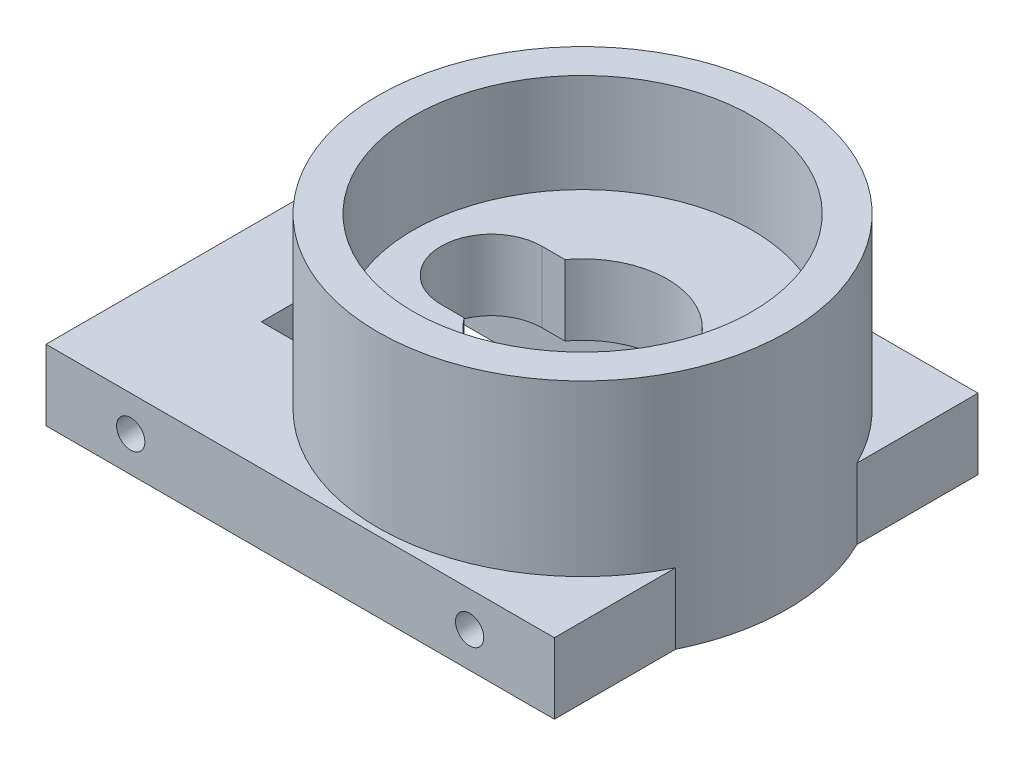
ISO-10303-21;
HEADER;
FILE_DESCRIPTION(('STEP AP214'),'2;1');
FILE_NAME('part.step','',(''),(''),'','','');
FILE_SCHEMA(('AUTOMOTIVE_DESIGN { 1 0 10303 214 1 1 1 1 }'));
ENDSEC;
DATA;
#1=APPLICATION_CONTEXT('core data for automotive mechanical design processes');
#2=APPLICATION_PROTOCOL_DEFINITION('international standard','automotive_design',2000,#1);
#3=PRODUCT_CONTEXT('',#1,'mechanical');
#4=PRODUCT('Part','Part','',(#3));
#5=PRODUCT_RELATED_PRODUCT_CATEGORY('part','',(#4));
#6=PRODUCT_DEFINITION_FORMATION('','',#4);
#7=PRODUCT_DEFINITION_CONTEXT('part definition',#1,'design');
#8=PRODUCT_DEFINITION('design','',#6,#7);
#9=PRODUCT_DEFINITION_SHAPE('','',#8);
#10=(LENGTH_UNIT() NAMED_UNIT(*) SI_UNIT(.MILLI.,.METRE.));
#11=(NAMED_UNIT(*) PLANE_ANGLE_UNIT() SI_UNIT($,.RADIAN.));
#12=(NAMED_UNIT(*) SI_UNIT($,.STERADIAN.) SOLID_ANGLE_UNIT());
#13=UNCERTAINTY_MEASURE_WITH_UNIT(LENGTH_MEASURE(1.E-05),#10,'distance_accuracy_value','');
#14=(GEOMETRIC_REPRESENTATION_CONTEXT(3) GLOBAL_UNCERTAINTY_ASSIGNED_CONTEXT((#13)) GLOBAL_UNIT_ASSIGNED_CONTEXT((#10,
#11,#12)) REPRESENTATION_CONTEXT('',''));
#15=CARTESIAN_POINT('',(0.,0.,0.));
#16=DIRECTION('',(0.,0.,1.));
#17=DIRECTION('',(1.,0.,0.));
#18=AXIS2_PLACEMENT_3D('',#15,#16,#17);
#19=CARTESIAN_POINT('',(0.,5.,0.));
#20=DIRECTION('',(0.,1.,0.));
#21=DIRECTION('',(0.,0.,1.));
#22=AXIS2_PLACEMENT_3D('',#19,#20,#21);
#23=PLANE('',#22);
#24=DIRECTION('',(-1.,0.,0.));
#25=VECTOR('',#24,1.);
#26=CARTESIAN_POINT('',(-11.75,5.,6.));
#27=LINE('',#26,#25);
#28=CARTESIAN_POINT('',(11.75,5.,6.));
#29=VERTEX_POINT('',#28);
#30=CARTESIAN_POINT('',(5.,5.,6.));
#31=VERTEX_POINT('',#30);
#32=EDGE_CURVE('E214',#29,#31,#27,.T.);
#33=ORIENTED_EDGE('',*,*,#32,.T.);
#34=CARTESIAN_POINT('',(5.,5.,0.));
#35=DIRECTION('',(0.,1.,0.));
#36=DIRECTION('',(0.,0.,1.));
#37=AXIS2_PLACEMENT_3D('',#34,#35,#36);
#38=CIRCLE('',#37,6.);
#39=CARTESIAN_POINT('',(5.,5.,-6.));
#40=VERTEX_POINT('',#39);
#41=EDGE_CURVE('E58',#40,#31,#38,.F.);
#42=ORIENTED_EDGE('',*,*,#41,.F.);
#43=DIRECTION('',(1.,0.,0.));
#44=VECTOR('',#43,1.);
#45=CARTESIAN_POINT('',(-11.75,5.,-6.));
#46=LINE('',#45,#44);
#47=CARTESIAN_POINT('',(11.75,5.,-6.));
#48=VERTEX_POINT('',#47);
#49=EDGE_CURVE('E228',#40,#48,#46,.T.);
#50=ORIENTED_EDGE('',*,*,#49,.T.);
#51=DIRECTION('',(0.,0.,1.));
#52=VECTOR('',#51,1.);
#53=CARTESIAN_POINT('',(11.75,5.,-6.));
#54=LINE('',#53,#52);
#55=EDGE_CURVE('E219',#48,#29,#54,.T.);
#56=ORIENTED_EDGE('',*,*,#55,.T.);
#57=EDGE_LOOP('',(#33,#42,#50,#56));
#58=FACE_BOUND('',#57,.T.);
#59=ADVANCED_FACE('F35',(#58),#23,.F.);
#60=CARTESIAN_POINT('',(0.,2.,0.));
#61=DIRECTION('',(0.,-1.,0.));
#62=DIRECTION('',(0.,0.,-1.));
#63=AXIS2_PLACEMENT_3D('',#60,#61,#62);
#64=PLANE('',#63);
#65=DIRECTION('',(0.,0.,-1.));
#66=VECTOR('',#65,1.);
#67=CARTESIAN_POINT('',(-11.75,2.,0.));
#68=LINE('',#67,#66);
#69=CARTESIAN_POINT('',(-11.75,2.,6.));
#70=VERTEX_POINT('',#69);
#71=CARTESIAN_POINT('',(-11.75,2.,-6.));
#72=VERTEX_POINT('',#71);
#73=EDGE_CURVE('E334',#70,#72,#68,.T.);
#74=ORIENTED_EDGE('',*,*,#73,.F.);
#75=DIRECTION('',(-1.,0.,0.));
#76=VECTOR('',#75,1.);
#77=CARTESIAN_POINT('',(-16.5,2.,6.));
#78=LINE('',#77,#76);
#79=CARTESIAN_POINT('',(-16.5,2.,6.));
#80=VERTEX_POINT('',#79);
#81=EDGE_CURVE('E255',#70,#80,#78,.T.);
#82=ORIENTED_EDGE('',*,*,#81,.T.);
#83=DIRECTION('',(0.,0.,-1.));
#84=VECTOR('',#83,1.);
#85=CARTESIAN_POINT('',(-16.5,2.,6.));
#86=LINE('',#85,#84);
#87=CARTESIAN_POINT('',(-16.5,2.,-6.));
#88=VERTEX_POINT('',#87);
#89=EDGE_CURVE('E260',#80,#88,#86,.T.);
#90=ORIENTED_EDGE('',*,*,#89,.T.);
#91=DIRECTION('',(1.,0.,0.));
#92=VECTOR('',#91,1.);
#93=CARTESIAN_POINT('',(-16.5,2.,-6.));
#94=LINE('',#93,#92);
#95=EDGE_CURVE('E264',#88,#72,#94,.T.);
#96=ORIENTED_EDGE('',*,*,#95,.T.);
#97=EDGE_LOOP('',(#74,#82,#90,#96));
#98=FACE_BOUND('',#97,.T.);
#99=CARTESIAN_POINT('',(-14.,2.,0.));
#100=DIRECTION('',(0.,-1.,0.));
#101=DIRECTION('',(0.,0.,-1.));
#102=AXIS2_PLACEMENT_3D('',#99,#100,#101);
#103=CIRCLE('',#102,1.);
#104=CARTESIAN_POINT('',(-14.,2.,-1.));
#105=VERTEX_POINT('',#104);
#106=EDGE_CURVE('E239',#105,#105,#103,.T.);
#107=ORIENTED_EDGE('',*,*,#106,.F.);
#108=EDGE_LOOP('',(#107));
#109=FACE_BOUND('',#108,.T.);
#110=ADVANCED_FACE('F379',(#98,#109),#64,.T.);
#111=CARTESIAN_POINT('',(18.,5.,-15.));
#112=DIRECTION('',(-1.,0.,0.));
#113=DIRECTION('',(0.,0.,1.));
#114=AXIS2_PLACEMENT_3D('',#111,#112,#113);
#115=PLANE('',#114);
#116=DIRECTION('',(0.,0.,-1.));
#117=VECTOR('',#116,1.);
#118=CARTESIAN_POINT('',(18.,5.,-15.));
#119=LINE('',#118,#117);
#120=CARTESIAN_POINT('',(18.,5.,-6.42261628933256));
#121=VERTEX_POINT('',#120);
#122=CARTESIAN_POINT('',(18.,5.,-15.));
#123=VERTEX_POINT('',#122);
#124=EDGE_CURVE('E306',#121,#123,#119,.T.);
#125=ORIENTED_EDGE('',*,*,#124,.F.);
#126=DIRECTION('',(0.,-1.,0.));
#127=VECTOR('',#126,1.);
#128=CARTESIAN_POINT('',(18.,17.,-6.42261628933256));
#129=LINE('',#128,#127);
#130=CARTESIAN_POINT('',(18.,0.,-6.42261628933256));
#131=VERTEX_POINT('',#130);
#132=EDGE_CURVE('E299',#121,#131,#129,.T.);
#133=ORIENTED_EDGE('',*,*,#132,.T.);
#134=DIRECTION('',(0.,0.,-1.));
#135=VECTOR('',#134,1.);
#136=CARTESIAN_POINT('',(18.,0.,-15.));
#137=LINE('',#136,#135);
#138=CARTESIAN_POINT('',(18.,0.,-15.));
#139=VERTEX_POINT('',#138);
#140=EDGE_CURVE('E301',#131,#139,#137,.T.);
#141=ORIENTED_EDGE('',*,*,#140,.T.);
#142=DIRECTION('',(0.,-1.,0.));
#143=VECTOR('',#142,1.);
#144=CARTESIAN_POINT('',(18.,5.,-15.));
#145=LINE('',#144,#143);
#146=EDGE_CURVE('E329',#123,#139,#145,.T.);
#147=ORIENTED_EDGE('',*,*,#146,.F.);
#148=EDGE_LOOP('',(#125,#133,#141,#147));
#149=FACE_BOUND('',#148,.T.);
#150=ADVANCED_FACE('F385',(#149),#115,.F.);
#151=CARTESIAN_POINT('',(18.,0.,15.));
#152=VERTEX_POINT('',#151);
#153=CARTESIAN_POINT('',(18.,0.,6.42261628933256));
#154=VERTEX_POINT('',#153);
#155=EDGE_CURVE('E313',#152,#154,#137,.T.);
#156=ORIENTED_EDGE('',*,*,#155,.T.);
#157=DIRECTION('',(0.,-1.,0.));
#158=VECTOR('',#157,1.);
#159=CARTESIAN_POINT('',(18.,17.,6.42261628933256));
#160=LINE('',#159,#158);
#161=CARTESIAN_POINT('',(18.,5.,6.42261628933256));
#162=VERTEX_POINT('',#161);
#163=EDGE_CURVE('E295',#154,#162,#160,.F.);
#164=ORIENTED_EDGE('',*,*,#163,.T.);
#165=CARTESIAN_POINT('',(18.,5.,15.));
#166=VERTEX_POINT('',#165);
#167=EDGE_CURVE('E302',#166,#162,#119,.T.);
#168=ORIENTED_EDGE('',*,*,#167,.F.);
#169=DIRECTION('',(0.,-1.,0.));
#170=VECTOR('',#169,1.);
#171=CARTESIAN_POINT('',(18.,5.,15.));
#172=LINE('',#171,#170);
#173=EDGE_CURVE('E312',#166,#152,#172,.T.);
#174=ORIENTED_EDGE('',*,*,#173,.T.);
#175=EDGE_LOOP('',(#156,#164,#168,#174));
#176=FACE_BOUND('',#175,.T.);
#177=ADVANCED_FACE('F37',(#176),#115,.F.);
#178=CARTESIAN_POINT('',(-18.,5.,-15.));
#179=DIRECTION('',(0.,0.,1.));
#180=DIRECTION('',(1.,0.,0.));
#181=AXIS2_PLACEMENT_3D('',#178,#179,#180);
#182=PLANE('',#181);
#183=CARTESIAN_POINT('',(12.,2.5,-15.));
#184=DIRECTION('',(0.,0.,-1.));
#185=DIRECTION('',(1.,0.,0.));
#186=AXIS2_PLACEMENT_3D('',#183,#184,#185);
#187=CIRCLE('',#186,1.);
#188=CARTESIAN_POINT('',(13.,2.5,-15.));
#189=VERTEX_POINT('',#188);
#190=EDGE_CURVE('E349',#189,#189,#187,.T.);
#191=ORIENTED_EDGE('',*,*,#190,.F.);
#192=EDGE_LOOP('',(#191));
#193=FACE_BOUND('',#192,.T.);
#194=CARTESIAN_POINT('',(-12.,2.5,-15.));
#195=DIRECTION('',(0.,0.,-1.));
#196=DIRECTION('',(-1.,0.,0.));
#197=AXIS2_PLACEMENT_3D('',#194,#195,#196);
#198=CIRCLE('',#197,1.);
#199=CARTESIAN_POINT('',(-13.,2.5,-15.));
#200=VERTEX_POINT('',#199);
#201=EDGE_CURVE('E343',#200,#200,#198,.T.);
#202=ORIENTED_EDGE('',*,*,#201,.F.);
#203=EDGE_LOOP('',(#202));
#204=FACE_BOUND('',#203,.T.);
#205=DIRECTION('',(-1.,0.,0.));
#206=VECTOR('',#205,1.);
#207=CARTESIAN_POINT('',(-18.,0.,-15.));
#208=LINE('',#207,#206);
#209=CARTESIAN_POINT('',(-18.,0.,-15.));
#210=VERTEX_POINT('',#209);
#211=EDGE_CURVE('E315',#139,#210,#208,.T.);
#212=ORIENTED_EDGE('',*,*,#211,.T.);
#213=DIRECTION('',(0.,-1.,0.));
#214=VECTOR('',#213,1.);
#215=CARTESIAN_POINT('',(-18.,5.,-15.));
#216=LINE('',#215,#214);
#217=CARTESIAN_POINT('',(-18.,5.,-15.));
#218=VERTEX_POINT('',#217);
#219=EDGE_CURVE('E326',#218,#210,#216,.T.);
#220=ORIENTED_EDGE('',*,*,#219,.F.);
#221=DIRECTION('',(-1.,0.,0.));
#222=VECTOR('',#221,1.);
#223=CARTESIAN_POINT('',(-18.,5.,-15.));
#224=LINE('',#223,#222);
#225=EDGE_CURVE('E305',#123,#218,#224,.T.);
#226=ORIENTED_EDGE('',*,*,#225,.F.);
#227=ORIENTED_EDGE('',*,*,#146,.T.);
#228=EDGE_LOOP('',(#212,#220,#226,#227));
#229=FACE_BOUND('',#228,.T.);
#230=ADVANCED_FACE('F454',(#193,#204,#229),#182,.F.);
#231=CARTESIAN_POINT('',(-18.,5.,-15.));
#232=DIRECTION('',(1.,0.,0.));
#233=DIRECTION('',(0.,0.,-1.));
#234=AXIS2_PLACEMENT_3D('',#231,#232,#233);
#235=PLANE('',#234);
#236=DIRECTION('',(0.,0.,1.));
#237=VECTOR('',#236,1.);
#238=CARTESIAN_POINT('',(-18.,0.,-15.));
#239=LINE('',#238,#237);
#240=CARTESIAN_POINT('',(-18.,0.,15.));
#241=VERTEX_POINT('',#240);
#242=EDGE_CURVE('E317',#210,#241,#239,.T.);
#243=ORIENTED_EDGE('',*,*,#242,.T.);
#244=DIRECTION('',(0.,-1.,0.));
#245=VECTOR('',#244,1.);
#246=CARTESIAN_POINT('',(-18.,5.,15.));
#247=LINE('',#246,#245);
#248=CARTESIAN_POINT('',(-18.,5.,15.));
#249=VERTEX_POINT('',#248);
#250=EDGE_CURVE('E323',#249,#241,#247,.T.);
#251=ORIENTED_EDGE('',*,*,#250,.F.);
#252=DIRECTION('',(0.,0.,1.));
#253=VECTOR('',#252,1.);
#254=CARTESIAN_POINT('',(-18.,5.,-15.));
#255=LINE('',#254,#253);
#256=EDGE_CURVE('E308',#218,#249,#255,.T.);
#257=ORIENTED_EDGE('',*,*,#256,.F.);
#258=ORIENTED_EDGE('',*,*,#219,.T.);
#259=EDGE_LOOP('',(#243,#251,#257,#258));
#260=FACE_BOUND('',#259,.T.);
#261=ADVANCED_FACE('F451',(#260),#235,.F.);
#262=CARTESIAN_POINT('',(-18.,5.,15.));
#263=DIRECTION('',(0.,0.,-1.));
#264=DIRECTION('',(-1.,0.,0.));
#265=AXIS2_PLACEMENT_3D('',#262,#263,#264);
#266=PLANE('',#265);
#267=CARTESIAN_POINT('',(12.,2.5,15.));
#268=DIRECTION('',(0.,0.,-1.));
#269=DIRECTION('',(1.,0.,0.));
#270=AXIS2_PLACEMENT_3D('',#267,#268,#269);
#271=CIRCLE('',#270,1.);
#272=CARTESIAN_POINT('',(13.,2.5,15.));
#273=VERTEX_POINT('',#272);
#274=EDGE_CURVE('E361',#273,#273,#271,.T.);
#275=ORIENTED_EDGE('',*,*,#274,.T.);
#276=EDGE_LOOP('',(#275));
#277=FACE_BOUND('',#276,.T.);
#278=CARTESIAN_POINT('',(-12.,2.5,15.));
#279=DIRECTION('',(0.,0.,-1.));
#280=DIRECTION('',(-1.,0.,0.));
#281=AXIS2_PLACEMENT_3D('',#278,#279,#280);
#282=CIRCLE('',#281,1.);
#283=CARTESIAN_POINT('',(-13.,2.5,15.));
#284=VERTEX_POINT('',#283);
#285=EDGE_CURVE('E355',#284,#284,#282,.T.);
#286=ORIENTED_EDGE('',*,*,#285,.T.);
#287=EDGE_LOOP('',(#286));
#288=FACE_BOUND('',#287,.T.);
#289=DIRECTION('',(1.,0.,0.));
#290=VECTOR('',#289,1.);
#291=CARTESIAN_POINT('',(-18.,0.,15.));
#292=LINE('',#291,#290);
#293=EDGE_CURVE('E319',#241,#152,#292,.T.);
#294=ORIENTED_EDGE('',*,*,#293,.T.);
#295=ORIENTED_EDGE('',*,*,#173,.F.);
#296=DIRECTION('',(1.,0.,0.));
#297=VECTOR('',#296,1.);
#298=CARTESIAN_POINT('',(-18.,5.,15.));
#299=LINE('',#298,#297);
#300=EDGE_CURVE('E310',#249,#166,#299,.T.);
#301=ORIENTED_EDGE('',*,*,#300,.F.);
#302=ORIENTED_EDGE('',*,*,#250,.T.);
#303=EDGE_LOOP('',(#294,#295,#301,#302));
#304=FACE_BOUND('',#303,.T.);
#305=ADVANCED_FACE('F444',(#277,#288,#304),#266,.F.);
#306=CARTESIAN_POINT('',(0.,5.,0.));
#307=DIRECTION('',(0.,1.,0.));
#308=DIRECTION('',(0.,0.,1.));
#309=AXIS2_PLACEMENT_3D('',#306,#307,#308);
#310=PLANE('',#309);
#311=CARTESIAN_POINT('',(-8.20037878244408,5.,6.));
#312=VERTEX_POINT('',#311);
#313=CARTESIAN_POINT('',(-11.75,5.,6.));
#314=VERTEX_POINT('',#313);
#315=EDGE_CURVE('E211',#312,#314,#27,.T.);
#316=ORIENTED_EDGE('',*,*,#315,.T.);
#317=DIRECTION('',(0.,0.,-1.));
#318=VECTOR('',#317,1.);
#319=CARTESIAN_POINT('',(-11.75,5.,-6.));
#320=LINE('',#319,#318);
#321=CARTESIAN_POINT('',(-11.75,5.,-6.));
#322=VERTEX_POINT('',#321);
#323=EDGE_CURVE('E229',#314,#322,#320,.T.);
#324=ORIENTED_EDGE('',*,*,#323,.T.);
#325=CARTESIAN_POINT('',(-8.20037878244408,5.,-6.));
#326=VERTEX_POINT('',#325);
#327=EDGE_CURVE('E224',#322,#326,#46,.T.);
#328=ORIENTED_EDGE('',*,*,#327,.T.);
#329=CARTESIAN_POINT('',(5.,5.,0.));
#330=DIRECTION('',(0.,1.,0.));
#331=DIRECTION('',(0.,0.,1.));
#332=AXIS2_PLACEMENT_3D('',#329,#330,#331);
#333=CIRCLE('',#332,14.5);
#334=EDGE_CURVE('E292',#121,#326,#333,.T.);
#335=ORIENTED_EDGE('',*,*,#334,.F.);
#336=ORIENTED_EDGE('',*,*,#124,.T.);
#337=ORIENTED_EDGE('',*,*,#225,.T.);
#338=ORIENTED_EDGE('',*,*,#256,.T.);
#339=ORIENTED_EDGE('',*,*,#300,.T.);
#340=ORIENTED_EDGE('',*,*,#167,.T.);
#341=EDGE_CURVE('E289',#312,#162,#333,.T.);
#342=ORIENTED_EDGE('',*,*,#341,.F.);
#343=EDGE_LOOP('',(#316,#324,#328,#335,#336,#337,#338,#339,#340,#342));
#344=FACE_BOUND('',#343,.T.);
#345=CARTESIAN_POINT('',(-14.,5.,0.));
#346=DIRECTION('',(0.,-1.,0.));
#347=DIRECTION('',(0.,0.,-1.));
#348=AXIS2_PLACEMENT_3D('',#345,#346,#347);
#349=CIRCLE('',#348,1.);
#350=CARTESIAN_POINT('',(-14.,5.,-1.));
#351=VERTEX_POINT('',#350);
#352=EDGE_CURVE('E240',#351,#351,#349,.T.);
#353=ORIENTED_EDGE('',*,*,#352,.T.);
#354=EDGE_LOOP('',(#353));
#355=FACE_BOUND('',#354,.T.);
#356=ADVANCED_FACE('F441',(#344,#355),#310,.T.);
#357=CARTESIAN_POINT('',(0.,0.,0.));
#358=DIRECTION('',(0.,1.,0.));
#359=DIRECTION('',(0.,0.,1.));
#360=AXIS2_PLACEMENT_3D('',#357,#358,#359);
#361=PLANE('',#360);
#362=DIRECTION('',(-1.,0.,0.));
#363=VECTOR('',#362,1.);
#364=CARTESIAN_POINT('',(-16.5,0.,6.));
#365=LINE('',#364,#363);
#366=CARTESIAN_POINT('',(16.5,0.,6.));
#367=VERTEX_POINT('',#366);
#368=CARTESIAN_POINT('',(-16.5,0.,6.));
#369=VERTEX_POINT('',#368);
#370=EDGE_CURVE('E269',#367,#369,#365,.T.);
#371=ORIENTED_EDGE('',*,*,#370,.F.);
#372=DIRECTION('',(0.,0.,1.));
#373=VECTOR('',#372,1.);
#374=CARTESIAN_POINT('',(16.5,0.,6.));
#375=LINE('',#374,#373);
#376=CARTESIAN_POINT('',(16.5,0.,-6.));
#377=VERTEX_POINT('',#376);
#378=EDGE_CURVE('E249',#377,#367,#375,.T.);
#379=ORIENTED_EDGE('',*,*,#378,.F.);
#380=DIRECTION('',(1.,0.,0.));
#381=VECTOR('',#380,1.);
#382=CARTESIAN_POINT('',(-16.5,0.,-6.));
#383=LINE('',#382,#381);
#384=CARTESIAN_POINT('',(-16.5,0.,-6.));
#385=VERTEX_POINT('',#384);
#386=EDGE_CURVE('E256',#385,#377,#383,.T.);
#387=ORIENTED_EDGE('',*,*,#386,.F.);
#388=DIRECTION('',(0.,0.,-1.));
#389=VECTOR('',#388,1.);
#390=CARTESIAN_POINT('',(-16.5,0.,6.));
#391=LINE('',#390,#389);
#392=EDGE_CURVE('E271',#369,#385,#391,.T.);
#393=ORIENTED_EDGE('',*,*,#392,.F.);
#394=EDGE_LOOP('',(#371,#379,#387,#393));
#395=FACE_BOUND('',#394,.T.);
#396=ORIENTED_EDGE('',*,*,#140,.F.);
#397=CARTESIAN_POINT('',(5.,0.,0.));
#398=DIRECTION('',(0.,-1.,0.));
#399=DIRECTION('',(0.,0.,-1.));
#400=AXIS2_PLACEMENT_3D('',#397,#398,#399);
#401=CIRCLE('',#400,14.5);
#402=EDGE_CURVE('E278',#131,#154,#401,.T.);
#403=ORIENTED_EDGE('',*,*,#402,.T.);
#404=ORIENTED_EDGE('',*,*,#155,.F.);
#405=ORIENTED_EDGE('',*,*,#293,.F.);
#406=ORIENTED_EDGE('',*,*,#242,.F.);
#407=ORIENTED_EDGE('',*,*,#211,.F.);
#408=EDGE_LOOP('',(#396,#403,#404,#405,#406,#407));
#409=FACE_BOUND('',#408,.T.);
#410=ADVANCED_FACE('F439',(#395,#409),#361,.F.);
#411=CARTESIAN_POINT('',(5.,17.,0.));
#412=DIRECTION('',(0.,-1.,0.));
#413=DIRECTION('',(0.,0.,-1.));
#414=AXIS2_PLACEMENT_3D('',#411,#412,#413);
#415=CYLINDRICAL_SURFACE('',#414,14.5);
#416=CARTESIAN_POINT('',(5.,17.,0.));
#417=DIRECTION('',(0.,-1.,0.));
#418=DIRECTION('',(0.,0.,-1.));
#419=AXIS2_PLACEMENT_3D('',#416,#417,#418);
#420=CIRCLE('',#419,14.5);
#421=CARTESIAN_POINT('',(5.,17.,-14.5));
#422=VERTEX_POINT('',#421);
#423=EDGE_CURVE('E286',#422,#422,#420,.T.);
#424=ORIENTED_EDGE('',*,*,#423,.T.);
#425=EDGE_LOOP('',(#424));
#426=FACE_BOUND('',#425,.T.);
#427=ORIENTED_EDGE('',*,*,#132,.F.);
#428=ORIENTED_EDGE('',*,*,#334,.T.);
#429=EDGE_CURVE('E296',#326,#312,#333,.T.);
#430=ORIENTED_EDGE('',*,*,#429,.T.);
#431=ORIENTED_EDGE('',*,*,#341,.T.);
#432=ORIENTED_EDGE('',*,*,#163,.F.);
#433=ORIENTED_EDGE('',*,*,#402,.F.);
#434=EDGE_LOOP('',(#427,#428,#430,#431,#432,#433));
#435=FACE_BOUND('',#434,.T.);
#436=ADVANCED_FACE('F435',(#426,#435),#415,.T.);
#437=CARTESIAN_POINT('',(5.,17.,0.));
#438=DIRECTION('',(0.,-1.,0.));
#439=DIRECTION('',(0.,0.,-1.));
#440=AXIS2_PLACEMENT_3D('',#437,#438,#439);
#441=PLANE('',#440);
#442=CARTESIAN_POINT('',(5.,17.,0.));
#443=DIRECTION('',(0.,1.,0.));
#444=DIRECTION('',(0.,0.,1.));
#445=AXIS2_PLACEMENT_3D('',#442,#443,#444);
#446=CIRCLE('',#445,12.);
#447=CARTESIAN_POINT('',(5.,17.,12.));
#448=VERTEX_POINT('',#447);
#449=EDGE_CURVE('E206',#448,#448,#446,.T.);
#450=ORIENTED_EDGE('',*,*,#449,.F.);
#451=EDGE_LOOP('',(#450));
#452=FACE_BOUND('',#451,.T.);
#453=ORIENTED_EDGE('',*,*,#423,.F.);
#454=EDGE_LOOP('',(#453));
#455=FACE_BOUND('',#454,.T.);
#456=ADVANCED_FACE('F431',(#452,#455),#441,.F.);
#457=CARTESIAN_POINT('',(16.5,2.,6.));
#458=DIRECTION('',(1.,0.,0.));
#459=DIRECTION('',(0.,0.,-1.));
#460=AXIS2_PLACEMENT_3D('',#457,#458,#459);
#461=PLANE('',#460);
#462=ORIENTED_EDGE('',*,*,#378,.T.);
#463=DIRECTION('',(0.,-1.,0.));
#464=VECTOR('',#463,1.);
#465=CARTESIAN_POINT('',(16.5,2.,6.));
#466=LINE('',#465,#464);
#467=CARTESIAN_POINT('',(16.5,2.,6.));
#468=VERTEX_POINT('',#467);
#469=EDGE_CURVE('E267',#468,#367,#466,.T.);
#470=ORIENTED_EDGE('',*,*,#469,.F.);
#471=DIRECTION('',(0.,0.,1.));
#472=VECTOR('',#471,1.);
#473=CARTESIAN_POINT('',(16.5,2.,6.));
#474=LINE('',#473,#472);
#475=CARTESIAN_POINT('',(16.5,2.,-6.));
#476=VERTEX_POINT('',#475);
#477=EDGE_CURVE('E252',#476,#468,#474,.T.);
#478=ORIENTED_EDGE('',*,*,#477,.F.);
#479=DIRECTION('',(0.,-1.,0.));
#480=VECTOR('',#479,1.);
#481=CARTESIAN_POINT('',(16.5,2.,-6.));
#482=LINE('',#481,#480);
#483=EDGE_CURVE('E275',#476,#377,#482,.T.);
#484=ORIENTED_EDGE('',*,*,#483,.T.);
#485=EDGE_LOOP('',(#462,#470,#478,#484));
#486=FACE_BOUND('',#485,.T.);
#487=ADVANCED_FACE('F421',(#486),#461,.F.);
#488=CARTESIAN_POINT('',(-16.5,2.,-6.));
#489=DIRECTION('',(0.,0.,-1.));
#490=DIRECTION('',(-1.,0.,0.));
#491=AXIS2_PLACEMENT_3D('',#488,#489,#490);
#492=PLANE('',#491);
#493=CARTESIAN_POINT('',(11.75,2.,-6.));
#494=VERTEX_POINT('',#493);
#495=EDGE_CURVE('E263',#494,#476,#94,.T.);
#496=ORIENTED_EDGE('',*,*,#495,.F.);
#497=DIRECTION('',(0.,-1.,0.));
#498=VECTOR('',#497,1.);
#499=CARTESIAN_POINT('',(11.75,31.3865496039175,-6.));
#500=LINE('',#499,#498);
#501=EDGE_CURVE('E223',#48,#494,#500,.T.);
#502=ORIENTED_EDGE('',*,*,#501,.F.);
#503=ORIENTED_EDGE('',*,*,#49,.F.);
#504=EDGE_CURVE('E227',#326,#40,#46,.T.);
#505=ORIENTED_EDGE('',*,*,#504,.F.);
#506=ORIENTED_EDGE('',*,*,#327,.F.);
#507=DIRECTION('',(0.,-1.,0.));
#508=VECTOR('',#507,1.);
#509=CARTESIAN_POINT('',(-11.75,31.3865496039175,-6.));
#510=LINE('',#509,#508);
#511=EDGE_CURVE('E232',#322,#72,#510,.T.);
#512=ORIENTED_EDGE('',*,*,#511,.T.);
#513=ORIENTED_EDGE('',*,*,#95,.F.);
#514=DIRECTION('',(0.,-1.,0.));
#515=VECTOR('',#514,1.);
#516=CARTESIAN_POINT('',(-16.5,2.,-6.));
#517=LINE('',#516,#515);
#518=EDGE_CURVE('E279',#88,#385,#517,.T.);
#519=ORIENTED_EDGE('',*,*,#518,.T.);
#520=ORIENTED_EDGE('',*,*,#386,.T.);
#521=ORIENTED_EDGE('',*,*,#483,.F.);
#522=EDGE_LOOP('',(#496,#502,#503,#505,#506,#512,#513,#519,#520,#521));
#523=FACE_BOUND('',#522,.T.);
#524=ADVANCED_FACE('F417',(#523),#492,.F.);
#525=CARTESIAN_POINT('',(-16.5,2.,6.));
#526=DIRECTION('',(-1.,0.,0.));
#527=DIRECTION('',(0.,0.,1.));
#528=AXIS2_PLACEMENT_3D('',#525,#526,#527);
#529=PLANE('',#528);
#530=ORIENTED_EDGE('',*,*,#392,.T.);
#531=ORIENTED_EDGE('',*,*,#518,.F.);
#532=ORIENTED_EDGE('',*,*,#89,.F.);
#533=DIRECTION('',(0.,-1.,0.));
#534=VECTOR('',#533,1.);
#535=CARTESIAN_POINT('',(-16.5,2.,6.));
#536=LINE('',#535,#534);
#537=EDGE_CURVE('E281',#80,#369,#536,.T.);
#538=ORIENTED_EDGE('',*,*,#537,.T.);
#539=EDGE_LOOP('',(#530,#531,#532,#538));
#540=FACE_BOUND('',#539,.T.);
#541=ADVANCED_FACE('F420',(#540),#529,.F.);
#542=CARTESIAN_POINT('',(-16.5,2.,6.));
#543=DIRECTION('',(0.,0.,1.));
#544=DIRECTION('',(1.,0.,0.));
#545=AXIS2_PLACEMENT_3D('',#542,#543,#544);
#546=PLANE('',#545);
#547=ORIENTED_EDGE('',*,*,#370,.T.);
#548=ORIENTED_EDGE('',*,*,#537,.F.);
#549=ORIENTED_EDGE('',*,*,#81,.F.);
#550=DIRECTION('',(0.,-1.,0.));
#551=VECTOR('',#550,1.);
#552=CARTESIAN_POINT('',(-11.75,31.3865496039175,6.));
#553=LINE('',#552,#551);
#554=EDGE_CURVE('E217',#314,#70,#553,.T.);
#555=ORIENTED_EDGE('',*,*,#554,.F.);
#556=ORIENTED_EDGE('',*,*,#315,.F.);
#557=EDGE_CURVE('E218',#31,#312,#27,.T.);
#558=ORIENTED_EDGE('',*,*,#557,.F.);
#559=ORIENTED_EDGE('',*,*,#32,.F.);
#560=DIRECTION('',(0.,-1.,0.));
#561=VECTOR('',#560,1.);
#562=CARTESIAN_POINT('',(11.75,31.3865496039175,6.));
#563=LINE('',#562,#561);
#564=CARTESIAN_POINT('',(11.75,2.,6.));
#565=VERTEX_POINT('',#564);
#566=EDGE_CURVE('E222',#29,#565,#563,.T.);
#567=ORIENTED_EDGE('',*,*,#566,.T.);
#568=EDGE_CURVE('E257',#468,#565,#78,.T.);
#569=ORIENTED_EDGE('',*,*,#568,.F.);
#570=ORIENTED_EDGE('',*,*,#469,.T.);
#571=EDGE_LOOP('',(#547,#548,#549,#555,#556,#558,#559,#567,#569,#570));
#572=FACE_BOUND('',#571,.T.);
#573=ADVANCED_FACE('F415',(#572),#546,.F.);
#574=DIRECTION('',(0.,0.,1.));
#575=VECTOR('',#574,1.);
#576=CARTESIAN_POINT('',(11.75,2.,0.));
#577=LINE('',#576,#575);
#578=EDGE_CURVE('E332',#494,#565,#577,.T.);
#579=ORIENTED_EDGE('',*,*,#578,.F.);
#580=ORIENTED_EDGE('',*,*,#495,.T.);
#581=ORIENTED_EDGE('',*,*,#477,.T.);
#582=ORIENTED_EDGE('',*,*,#568,.T.);
#583=EDGE_LOOP('',(#579,#580,#581,#582));
#584=FACE_BOUND('',#583,.T.);
#585=CARTESIAN_POINT('',(14.,2.,0.));
#586=DIRECTION('',(0.,-1.,0.));
#587=DIRECTION('',(0.,0.,-1.));
#588=AXIS2_PLACEMENT_3D('',#585,#586,#587);
#589=CIRCLE('',#588,1.);
#590=CARTESIAN_POINT('',(14.,2.,-1.));
#591=VERTEX_POINT('',#590);
#592=EDGE_CURVE('E243',#591,#591,#589,.T.);
#593=ORIENTED_EDGE('',*,*,#592,.F.);
#594=EDGE_LOOP('',(#593));
#595=FACE_BOUND('',#594,.T.);
#596=ADVANCED_FACE('F388',(#584,#595),#64,.T.);
#597=CARTESIAN_POINT('',(14.,5.,0.));
#598=DIRECTION('',(0.,-1.,0.));
#599=DIRECTION('',(0.,0.,-1.));
#600=AXIS2_PLACEMENT_3D('',#597,#598,#599);
#601=CYLINDRICAL_SURFACE('',#600,1.);
#602=CARTESIAN_POINT('',(14.,5.,0.));
#603=DIRECTION('',(0.,-1.,0.));
#604=DIRECTION('',(0.,0.,-1.));
#605=AXIS2_PLACEMENT_3D('',#602,#603,#604);
#606=CIRCLE('',#605,1.);
#607=CARTESIAN_POINT('',(14.,5.,-1.));
#608=VERTEX_POINT('',#607);
#609=EDGE_CURVE('E246',#608,#608,#606,.T.);
#610=ORIENTED_EDGE('',*,*,#609,.F.);
#611=EDGE_LOOP('',(#610));
#612=FACE_BOUND('',#611,.T.);
#613=ORIENTED_EDGE('',*,*,#592,.T.);
#614=EDGE_LOOP('',(#613));
#615=FACE_BOUND('',#614,.T.);
#616=ADVANCED_FACE('F405',(#612,#615),#601,.F.);
#617=CARTESIAN_POINT('',(14.,5.,0.));
#618=DIRECTION('',(0.,-1.,0.));
#619=DIRECTION('',(0.,0.,-1.));
#620=AXIS2_PLACEMENT_3D('',#617,#618,#619);
#621=PLANE('',#620);
#622=ORIENTED_EDGE('',*,*,#609,.T.);
#623=EDGE_LOOP('',(#622));
#624=FACE_BOUND('',#623,.T.);
#625=ADVANCED_FACE('F400',(#624),#621,.T.);
#626=CARTESIAN_POINT('',(-14.,5.,0.));
#627=DIRECTION('',(0.,-1.,0.));
#628=DIRECTION('',(0.,0.,-1.));
#629=AXIS2_PLACEMENT_3D('',#626,#627,#628);
#630=CYLINDRICAL_SURFACE('',#629,1.);
#631=ORIENTED_EDGE('',*,*,#352,.F.);
#632=EDGE_LOOP('',(#631));
#633=FACE_BOUND('',#632,.T.);
#634=ORIENTED_EDGE('',*,*,#106,.T.);
#635=EDGE_LOOP('',(#634));
#636=FACE_BOUND('',#635,.T.);
#637=ADVANCED_FACE('F393',(#633,#636),#630,.F.);
#638=CARTESIAN_POINT('',(0.178323527786514,5.,-3.57091528845238));
#639=VERTEX_POINT('',#638);
#640=EDGE_CURVE('E207',#639,#40,#38,.F.);
#641=ORIENTED_EDGE('',*,*,#640,.F.);
#642=DIRECTION('',(1.,0.,0.));
#643=VECTOR('',#642,1.);
#644=CARTESIAN_POINT('',(-1.4554925367527,5.,-3.57091528845238));
#645=LINE('',#644,#643);
#646=CARTESIAN_POINT('',(-1.4554925367527,5.,-3.57091528845238));
#647=VERTEX_POINT('',#646);
#648=EDGE_CURVE('E199',#647,#639,#645,.T.);
#649=ORIENTED_EDGE('',*,*,#648,.F.);
#650=CARTESIAN_POINT('',(-1.4554925367527,5.,0.));
#651=DIRECTION('',(0.,1.,0.));
#652=DIRECTION('',(0.,0.,1.));
#653=AXIS2_PLACEMENT_3D('',#650,#651,#652);
#654=CIRCLE('',#653,3.57091528845238);
#655=CARTESIAN_POINT('',(-1.4554925367527,5.,3.57091528845238));
#656=VERTEX_POINT('',#655);
#657=EDGE_CURVE('E202',#656,#647,#654,.F.);
#658=ORIENTED_EDGE('',*,*,#657,.F.);
#659=DIRECTION('',(-1.,0.,0.));
#660=VECTOR('',#659,1.);
#661=CARTESIAN_POINT('',(2.11542275169968,5.,3.57091528845238));
#662=LINE('',#661,#660);
#663=CARTESIAN_POINT('',(0.178323527786514,5.,3.57091528845238));
#664=VERTEX_POINT('',#663);
#665=EDGE_CURVE('E175',#664,#656,#662,.T.);
#666=ORIENTED_EDGE('',*,*,#665,.F.);
#667=EDGE_CURVE('E204',#31,#664,#38,.F.);
#668=ORIENTED_EDGE('',*,*,#667,.F.);
#669=ORIENTED_EDGE('',*,*,#557,.T.);
#670=ORIENTED_EDGE('',*,*,#429,.F.);
#671=ORIENTED_EDGE('',*,*,#504,.T.);
#672=EDGE_LOOP('',(#641,#649,#658,#666,#668,#669,#670,#671));
#673=FACE_BOUND('',#672,.T.);
#674=ADVANCED_FACE('F338',(#673),#23,.F.);
#675=CARTESIAN_POINT('',(-11.75,31.3865496039175,-6.));
#676=DIRECTION('',(-1.,0.,0.));
#677=DIRECTION('',(0.,0.,1.));
#678=AXIS2_PLACEMENT_3D('',#675,#676,#677);
#679=PLANE('',#678);
#680=ORIENTED_EDGE('',*,*,#73,.T.);
#681=ORIENTED_EDGE('',*,*,#511,.F.);
#682=ORIENTED_EDGE('',*,*,#323,.F.);
#683=ORIENTED_EDGE('',*,*,#554,.T.);
#684=EDGE_LOOP('',(#680,#681,#682,#683));
#685=FACE_BOUND('',#684,.T.);
#686=ADVANCED_FACE('F392',(#685),#679,.F.);
#687=CARTESIAN_POINT('',(11.75,31.3865496039175,-6.));
#688=DIRECTION('',(1.,0.,0.));
#689=DIRECTION('',(0.,0.,-1.));
#690=AXIS2_PLACEMENT_3D('',#687,#688,#689);
#691=PLANE('',#690);
#692=ORIENTED_EDGE('',*,*,#578,.T.);
#693=ORIENTED_EDGE('',*,*,#566,.F.);
#694=ORIENTED_EDGE('',*,*,#55,.F.);
#695=ORIENTED_EDGE('',*,*,#501,.T.);
#696=EDGE_LOOP('',(#692,#693,#694,#695));
#697=FACE_BOUND('',#696,.T.);
#698=ADVANCED_FACE('F398',(#697),#691,.F.);
#699=CARTESIAN_POINT('',(5.,10.,0.));
#700=DIRECTION('',(0.,1.,0.));
#701=DIRECTION('',(0.,0.,1.));
#702=AXIS2_PLACEMENT_3D('',#699,#700,#701);
#703=CYLINDRICAL_SURFACE('',#702,12.);
#704=CARTESIAN_POINT('',(5.,10.,0.));
#705=DIRECTION('',(0.,1.,0.));
#706=DIRECTION('',(0.,0.,1.));
#707=AXIS2_PLACEMENT_3D('',#704,#705,#706);
#708=CIRCLE('',#707,12.);
#709=CARTESIAN_POINT('',(5.,10.,12.));
#710=VERTEX_POINT('',#709);
#711=EDGE_CURVE('E208',#710,#710,#708,.T.);
#712=ORIENTED_EDGE('',*,*,#711,.F.);
#713=EDGE_LOOP('',(#712));
#714=FACE_BOUND('',#713,.T.);
#715=ORIENTED_EDGE('',*,*,#449,.T.);
#716=EDGE_LOOP('',(#715));
#717=FACE_BOUND('',#716,.T.);
#718=ADVANCED_FACE('F535',(#714,#717),#703,.F.);
#719=CARTESIAN_POINT('',(5.,10.,0.));
#720=DIRECTION('',(0.,1.,0.));
#721=DIRECTION('',(0.,0.,1.));
#722=AXIS2_PLACEMENT_3D('',#719,#720,#721);
#723=PLANE('',#722);
#724=DIRECTION('',(-1.,0.,0.));
#725=VECTOR('',#724,1.);
#726=CARTESIAN_POINT('',(-1.4554925367527,10.,-3.57091528845238));
#727=LINE('',#726,#725);
#728=CARTESIAN_POINT('',(0.178323527786514,10.,-3.57091528845238));
#729=VERTEX_POINT('',#728);
#730=CARTESIAN_POINT('',(-1.4554925367527,10.,-3.57091528845238));
#731=VERTEX_POINT('',#730);
#732=EDGE_CURVE('E179',#729,#731,#727,.T.);
#733=ORIENTED_EDGE('',*,*,#732,.F.);
#734=CARTESIAN_POINT('',(5.,10.,0.));
#735=DIRECTION('',(0.,1.,0.));
#736=DIRECTION('',(0.,0.,1.));
#737=AXIS2_PLACEMENT_3D('',#734,#735,#736);
#738=CIRCLE('',#737,6.);
#739=CARTESIAN_POINT('',(0.178323527786515,10.,3.57091528845238));
#740=VERTEX_POINT('',#739);
#741=EDGE_CURVE('E194',#740,#729,#738,.T.);
#742=ORIENTED_EDGE('',*,*,#741,.F.);
#743=DIRECTION('',(1.,0.,0.));
#744=VECTOR('',#743,1.);
#745=CARTESIAN_POINT('',(2.11542275169968,10.,3.57091528845238));
#746=LINE('',#745,#744);
#747=CARTESIAN_POINT('',(-1.4554925367527,10.,3.57091528845238));
#748=VERTEX_POINT('',#747);
#749=EDGE_CURVE('E50',#748,#740,#746,.T.);
#750=ORIENTED_EDGE('',*,*,#749,.F.);
#751=CARTESIAN_POINT('',(-1.4554925367527,10.,0.));
#752=DIRECTION('',(0.,1.,0.));
#753=DIRECTION('',(0.,0.,1.));
#754=AXIS2_PLACEMENT_3D('',#751,#752,#753);
#755=CIRCLE('',#754,3.57091528845238);
#756=EDGE_CURVE('E183',#731,#748,#755,.T.);
#757=ORIENTED_EDGE('',*,*,#756,.F.);
#758=EDGE_LOOP('',(#733,#742,#750,#757));
#759=FACE_BOUND('',#758,.T.);
#760=ORIENTED_EDGE('',*,*,#711,.T.);
#761=EDGE_LOOP('',(#760));
#762=FACE_BOUND('',#761,.T.);
#763=ADVANCED_FACE('F191',(#759,#762),#723,.T.);
#764=CARTESIAN_POINT('',(5.,-11.9705627484771,0.));
#765=DIRECTION('',(0.,1.,0.));
#766=DIRECTION('',(0.,0.,1.));
#767=AXIS2_PLACEMENT_3D('',#764,#765,#766);
#768=CYLINDRICAL_SURFACE('',#767,6.);
#769=ORIENTED_EDGE('',*,*,#741,.T.);
#770=DIRECTION('',(0.,1.,0.));
#771=VECTOR('',#770,1.);
#772=CARTESIAN_POINT('',(0.178323527786514,-11.9705627484771,-3.57091528845238));
#773=LINE('',#772,#771);
#774=EDGE_CURVE('E11',#729,#639,#773,.F.);
#775=ORIENTED_EDGE('',*,*,#774,.T.);
#776=ORIENTED_EDGE('',*,*,#640,.T.);
#777=ORIENTED_EDGE('',*,*,#41,.T.);
#778=ORIENTED_EDGE('',*,*,#667,.T.);
#779=DIRECTION('',(0.,1.,0.));
#780=VECTOR('',#779,1.);
#781=CARTESIAN_POINT('',(0.178323527786514,-11.9705627484771,3.57091528845238));
#782=LINE('',#781,#780);
#783=EDGE_CURVE('E43',#664,#740,#782,.T.);
#784=ORIENTED_EDGE('',*,*,#783,.T.);
#785=EDGE_LOOP('',(#769,#775,#776,#777,#778,#784));
#786=FACE_BOUND('',#785,.T.);
#787=ADVANCED_FACE('F335',(#786),#768,.F.);
#788=CARTESIAN_POINT('',(-1.4554925367527,-5.10007366202957,-3.57091528845238));
#789=DIRECTION('',(0.,0.,-1.));
#790=DIRECTION('',(-1.,0.,0.));
#791=AXIS2_PLACEMENT_3D('',#788,#789,#790);
#792=PLANE('',#791);
#793=ORIENTED_EDGE('',*,*,#732,.T.);
#794=DIRECTION('',(0.,1.,0.));
#795=VECTOR('',#794,1.);
#796=CARTESIAN_POINT('',(-1.4554925367527,-5.10007366202957,-3.57091528845238));
#797=LINE('',#796,#795);
#798=EDGE_CURVE('E178',#647,#731,#797,.T.);
#799=ORIENTED_EDGE('',*,*,#798,.F.);
#800=ORIENTED_EDGE('',*,*,#648,.T.);
#801=ORIENTED_EDGE('',*,*,#774,.F.);
#802=EDGE_LOOP('',(#793,#799,#800,#801));
#803=FACE_BOUND('',#802,.T.);
#804=ADVANCED_FACE('F518',(#803),#792,.F.);
#805=CARTESIAN_POINT('',(2.11542275169968,-5.10007366202957,3.57091528845238));
#806=DIRECTION('',(0.,0.,1.));
#807=DIRECTION('',(1.,0.,0.));
#808=AXIS2_PLACEMENT_3D('',#805,#806,#807);
#809=PLANE('',#808);
#810=ORIENTED_EDGE('',*,*,#665,.T.);
#811=DIRECTION('',(0.,1.,0.));
#812=VECTOR('',#811,1.);
#813=CARTESIAN_POINT('',(-1.4554925367527,-5.10007366202957,3.57091528845238));
#814=LINE('',#813,#812);
#815=EDGE_CURVE('E171',#656,#748,#814,.T.);
#816=ORIENTED_EDGE('',*,*,#815,.T.);
#817=ORIENTED_EDGE('',*,*,#749,.T.);
#818=ORIENTED_EDGE('',*,*,#783,.F.);
#819=EDGE_LOOP('',(#810,#816,#817,#818));
#820=FACE_BOUND('',#819,.T.);
#821=ADVANCED_FACE('F173',(#820),#809,.F.);
#822=CARTESIAN_POINT('',(-1.4554925367527,-5.10007366202957,0.));
#823=DIRECTION('',(0.,1.,0.));
#824=DIRECTION('',(0.,0.,1.));
#825=AXIS2_PLACEMENT_3D('',#822,#823,#824);
#826=CYLINDRICAL_SURFACE('',#825,3.57091528845238);
#827=ORIENTED_EDGE('',*,*,#657,.T.);
#828=ORIENTED_EDGE('',*,*,#798,.T.);
#829=ORIENTED_EDGE('',*,*,#756,.T.);
#830=ORIENTED_EDGE('',*,*,#815,.F.);
#831=EDGE_LOOP('',(#827,#828,#829,#830));
#832=FACE_BOUND('',#831,.T.);
#833=ADVANCED_FACE('F184',(#832),#826,.F.);
#834=CARTESIAN_POINT('',(-12.,2.5,-10.));
#835=DIRECTION('',(0.,0.,-1.));
#836=DIRECTION('',(-1.,0.,0.));
#837=AXIS2_PLACEMENT_3D('',#834,#835,#836);
#838=CYLINDRICAL_SURFACE('',#837,1.);
#839=CARTESIAN_POINT('',(-12.,2.5,-10.));
#840=DIRECTION('',(0.,0.,-1.));
#841=DIRECTION('',(-1.,0.,0.));
#842=AXIS2_PLACEMENT_3D('',#839,#840,#841);
#843=CIRCLE('',#842,1.);
#844=CARTESIAN_POINT('',(-13.,2.5,-10.));
#845=VERTEX_POINT('',#844);
#846=EDGE_CURVE('E188',#845,#845,#843,.T.);
#847=ORIENTED_EDGE('',*,*,#846,.F.);
#848=EDGE_LOOP('',(#847));
#849=FACE_BOUND('',#848,.T.);
#850=ORIENTED_EDGE('',*,*,#201,.T.);
#851=EDGE_LOOP('',(#850));
#852=FACE_BOUND('',#851,.T.);
#853=ADVANCED_FACE('F528',(#849,#852),#838,.F.);
#854=CARTESIAN_POINT('',(-12.,2.5,-10.));
#855=DIRECTION('',(0.,0.,-1.));
#856=DIRECTION('',(-1.,0.,0.));
#857=AXIS2_PLACEMENT_3D('',#854,#855,#856);
#858=PLANE('',#857);
#859=ORIENTED_EDGE('',*,*,#846,.T.);
#860=EDGE_LOOP('',(#859));
#861=FACE_BOUND('',#860,.T.);
#862=ADVANCED_FACE('F589',(#861),#858,.T.);
#863=CARTESIAN_POINT('',(12.,2.5,-10.));
#864=DIRECTION('',(0.,0.,-1.));
#865=DIRECTION('',(-1.,0.,0.));
#866=AXIS2_PLACEMENT_3D('',#863,#864,#865);
#867=CYLINDRICAL_SURFACE('',#866,1.);
#868=CARTESIAN_POINT('',(12.,2.5,-10.));
#869=DIRECTION('',(0.,0.,-1.));
#870=DIRECTION('',(1.,0.,0.));
#871=AXIS2_PLACEMENT_3D('',#868,#869,#870);
#872=CIRCLE('',#871,1.);
#873=CARTESIAN_POINT('',(13.,2.5,-10.));
#874=VERTEX_POINT('',#873);
#875=EDGE_CURVE('E346',#874,#874,#872,.T.);
#876=ORIENTED_EDGE('',*,*,#875,.F.);
#877=EDGE_LOOP('',(#876));
#878=FACE_BOUND('',#877,.T.);
#879=ORIENTED_EDGE('',*,*,#190,.T.);
#880=EDGE_LOOP('',(#879));
#881=FACE_BOUND('',#880,.T.);
#882=ADVANCED_FACE('F598',(#878,#881),#867,.F.);
#883=CARTESIAN_POINT('',(12.,2.5,-10.));
#884=DIRECTION('',(0.,0.,1.));
#885=DIRECTION('',(1.,0.,0.));
#886=AXIS2_PLACEMENT_3D('',#883,#884,#885);
#887=PLANE('',#886);
#888=ORIENTED_EDGE('',*,*,#875,.T.);
#889=EDGE_LOOP('',(#888));
#890=FACE_BOUND('',#889,.T.);
#891=ADVANCED_FACE('F607',(#890),#887,.F.);
#892=CARTESIAN_POINT('',(-12.,2.5,10.));
#893=DIRECTION('',(0.,0.,1.));
#894=DIRECTION('',(1.,0.,0.));
#895=AXIS2_PLACEMENT_3D('',#892,#893,#894);
#896=CYLINDRICAL_SURFACE('',#895,1.);
#897=CARTESIAN_POINT('',(-12.,2.5,10.));
#898=DIRECTION('',(0.,0.,-1.));
#899=DIRECTION('',(-1.,0.,0.));
#900=AXIS2_PLACEMENT_3D('',#897,#898,#899);
#901=CIRCLE('',#900,1.);
#902=CARTESIAN_POINT('',(-13.,2.5,10.));
#903=VERTEX_POINT('',#902);
#904=EDGE_CURVE('E352',#903,#903,#901,.T.);
#905=ORIENTED_EDGE('',*,*,#904,.T.);
#906=EDGE_LOOP('',(#905));
#907=FACE_BOUND('',#906,.T.);
#908=ORIENTED_EDGE('',*,*,#285,.F.);
#909=EDGE_LOOP('',(#908));
#910=FACE_BOUND('',#909,.T.);
#911=ADVANCED_FACE('F617',(#907,#910),#896,.F.);
#912=CARTESIAN_POINT('',(-12.,2.5,10.));
#913=DIRECTION('',(0.,0.,1.));
#914=DIRECTION('',(-1.,0.,0.));
#915=AXIS2_PLACEMENT_3D('',#912,#913,#914);
#916=PLANE('',#915);
#917=ORIENTED_EDGE('',*,*,#904,.F.);
#918=EDGE_LOOP('',(#917));
#919=FACE_BOUND('',#918,.T.);
#920=ADVANCED_FACE('F376',(#919),#916,.T.);
#921=CARTESIAN_POINT('',(12.,2.5,10.));
#922=DIRECTION('',(0.,0.,1.));
#923=DIRECTION('',(1.,0.,0.));
#924=AXIS2_PLACEMENT_3D('',#921,#922,#923);
#925=CYLINDRICAL_SURFACE('',#924,1.);
#926=CARTESIAN_POINT('',(12.,2.5,10.));
#927=DIRECTION('',(0.,0.,-1.));
#928=DIRECTION('',(1.,0.,0.));
#929=AXIS2_PLACEMENT_3D('',#926,#927,#928);
#930=CIRCLE('',#929,1.);
#931=CARTESIAN_POINT('',(13.,2.5,10.));
#932=VERTEX_POINT('',#931);
#933=EDGE_CURVE('E358',#932,#932,#930,.T.);
#934=ORIENTED_EDGE('',*,*,#933,.T.);
#935=EDGE_LOOP('',(#934));
#936=FACE_BOUND('',#935,.T.);
#937=ORIENTED_EDGE('',*,*,#274,.F.);
#938=EDGE_LOOP('',(#937));
#939=FACE_BOUND('',#938,.T.);
#940=ADVANCED_FACE('F367',(#936,#939),#925,.F.);
#941=CARTESIAN_POINT('',(12.,2.5,10.));
#942=DIRECTION('',(0.,0.,-1.));
#943=DIRECTION('',(1.,0.,0.));
#944=AXIS2_PLACEMENT_3D('',#941,#942,#943);
#945=PLANE('',#944);
#946=ORIENTED_EDGE('',*,*,#933,.F.);
#947=EDGE_LOOP('',(#946));
#948=FACE_BOUND('',#947,.T.);
#949=ADVANCED_FACE('F370',(#948),#945,.F.);
#950=CLOSED_SHELL('',(#59,#110,#150,#177,#230,#261,#305,#356,#410,#436,#456,#487,#524,#541,#573,
#596,#616,#625,#637,#674,#686,#698,#718,#763,#787,#804,#821,#833,#853,#862,#882,#891,#911,#920,
#940,#949));
#951=MANIFOLD_SOLID_BREP('B2',#950);
#952=ADVANCED_BREP_SHAPE_REPRESENTATION('',(#18,#951),#14);
#953=SHAPE_DEFINITION_REPRESENTATION(#9,#952);
ENDSEC;
END-ISO-10303-21;
